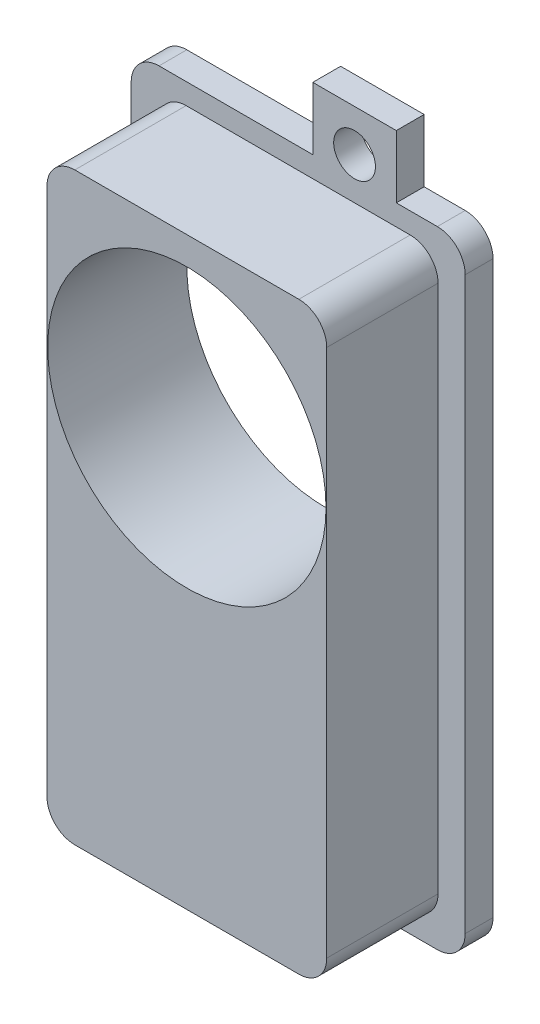
ISO-10303-21;
HEADER;
FILE_DESCRIPTION(('STEP AP214'),'2;1');
FILE_NAME('part.step','',(''),(''),'','','');
FILE_SCHEMA(('AUTOMOTIVE_DESIGN { 1 0 10303 214 1 1 1 1 }'));
ENDSEC;
DATA;
#1=APPLICATION_CONTEXT('core data for automotive mechanical design processes');
#2=APPLICATION_PROTOCOL_DEFINITION('international standard','automotive_design',2000,#1);
#3=PRODUCT_CONTEXT('',#1,'mechanical');
#4=PRODUCT('Part','Part','',(#3));
#5=PRODUCT_RELATED_PRODUCT_CATEGORY('part','',(#4));
#6=PRODUCT_DEFINITION_FORMATION('','',#4);
#7=PRODUCT_DEFINITION_CONTEXT('part definition',#1,'design');
#8=PRODUCT_DEFINITION('design','',#6,#7);
#9=PRODUCT_DEFINITION_SHAPE('','',#8);
#10=(LENGTH_UNIT() NAMED_UNIT(*) SI_UNIT(.MILLI.,.METRE.));
#11=(NAMED_UNIT(*) PLANE_ANGLE_UNIT() SI_UNIT($,.RADIAN.));
#12=(NAMED_UNIT(*) SI_UNIT($,.STERADIAN.) SOLID_ANGLE_UNIT());
#13=UNCERTAINTY_MEASURE_WITH_UNIT(LENGTH_MEASURE(1.E-05),#10,'distance_accuracy_value','');
#14=(GEOMETRIC_REPRESENTATION_CONTEXT(3) GLOBAL_UNCERTAINTY_ASSIGNED_CONTEXT((#13)) GLOBAL_UNIT_ASSIGNED_CONTEXT((#10,
#11,#12)) REPRESENTATION_CONTEXT('',''));
#15=CARTESIAN_POINT('',(0.,0.,0.));
#16=DIRECTION('',(0.,0.,1.));
#17=DIRECTION('',(1.,0.,0.));
#18=AXIS2_PLACEMENT_3D('',#15,#16,#17);
#19=CARTESIAN_POINT('',(0.,0.,2.));
#20=DIRECTION('',(0.,0.,-1.));
#21=DIRECTION('',(-1.,0.,0.));
#22=AXIS2_PLACEMENT_3D('',#19,#20,#21);
#23=PLANE('',#22);
#24=CARTESIAN_POINT('',(-4.05,-24.,2.));
#25=DIRECTION('',(0.,0.,1.));
#26=DIRECTION('',(1.,0.,0.));
#27=AXIS2_PLACEMENT_3D('',#24,#25,#26);
#28=CIRCLE('',#27,1.5);
#29=CARTESIAN_POINT('',(-2.55,-24.,2.));
#30=VERTEX_POINT('',#29);
#31=EDGE_CURVE('E467',#30,#30,#28,.T.);
#32=ORIENTED_EDGE('',*,*,#31,.F.);
#33=EDGE_LOOP('',(#32));
#34=FACE_BOUND('',#33,.T.);
#35=CARTESIAN_POINT('',(4.05,24.,2.));
#36=DIRECTION('',(0.,0.,1.));
#37=DIRECTION('',(1.,0.,0.));
#38=AXIS2_PLACEMENT_3D('',#35,#36,#37);
#39=CIRCLE('',#38,1.5);
#40=CARTESIAN_POINT('',(5.55,24.,2.));
#41=VERTEX_POINT('',#40);
#42=EDGE_CURVE('E263',#41,#41,#39,.T.);
#43=ORIENTED_EDGE('',*,*,#42,.F.);
#44=EDGE_LOOP('',(#43));
#45=FACE_BOUND('',#44,.T.);
#46=DIRECTION('',(1.,0.,0.));
#47=VECTOR('',#46,1.);
#48=CARTESIAN_POINT('',(12.,-22.5,2.));
#49=LINE('',#48,#47);
#50=CARTESIAN_POINT('',(-1.05,-22.5,2.));
#51=VERTEX_POINT('',#50);
#52=CARTESIAN_POINT('',(10.,-22.5,2.));
#53=VERTEX_POINT('',#52);
#54=EDGE_CURVE('E238',#51,#53,#49,.T.);
#55=ORIENTED_EDGE('',*,*,#54,.T.);
#56=CARTESIAN_POINT('',(10.,-20.5,2.));
#57=DIRECTION('',(0.,0.,-1.));
#58=DIRECTION('',(-1.,0.,0.));
#59=AXIS2_PLACEMENT_3D('',#56,#57,#58);
#60=CIRCLE('',#59,2.);
#61=CARTESIAN_POINT('',(12.,-20.5,2.));
#62=VERTEX_POINT('',#61);
#63=EDGE_CURVE('E353',#53,#62,#60,.F.);
#64=ORIENTED_EDGE('',*,*,#63,.T.);
#65=DIRECTION('',(0.,1.,0.));
#66=VECTOR('',#65,1.);
#67=CARTESIAN_POINT('',(12.,-22.5,2.));
#68=LINE('',#67,#66);
#69=CARTESIAN_POINT('',(12.,20.5,2.));
#70=VERTEX_POINT('',#69);
#71=EDGE_CURVE('E241',#62,#70,#68,.T.);
#72=ORIENTED_EDGE('',*,*,#71,.T.);
#73=CARTESIAN_POINT('',(10.,20.5,2.));
#74=DIRECTION('',(0.,0.,-1.));
#75=DIRECTION('',(-1.,0.,0.));
#76=AXIS2_PLACEMENT_3D('',#73,#74,#75);
#77=CIRCLE('',#76,2.);
#78=CARTESIAN_POINT('',(10.,22.5,2.));
#79=VERTEX_POINT('',#78);
#80=EDGE_CURVE('E345',#70,#79,#77,.F.);
#81=ORIENTED_EDGE('',*,*,#80,.T.);
#82=DIRECTION('',(-1.,0.,0.));
#83=VECTOR('',#82,1.);
#84=CARTESIAN_POINT('',(12.,22.5,2.));
#85=LINE('',#84,#83);
#86=CARTESIAN_POINT('',(7.05,22.5,2.));
#87=VERTEX_POINT('',#86);
#88=EDGE_CURVE('E245',#79,#87,#85,.T.);
#89=ORIENTED_EDGE('',*,*,#88,.T.);
#90=DIRECTION('',(0.,1.,0.));
#91=VECTOR('',#90,1.);
#92=CARTESIAN_POINT('',(7.05,27.,2.));
#93=LINE('',#92,#91);
#94=CARTESIAN_POINT('',(7.05,27.,2.));
#95=VERTEX_POINT('',#94);
#96=EDGE_CURVE('E248',#87,#95,#93,.T.);
#97=ORIENTED_EDGE('',*,*,#96,.T.);
#98=DIRECTION('',(-1.,0.,0.));
#99=VECTOR('',#98,1.);
#100=CARTESIAN_POINT('',(1.05,27.,2.));
#101=LINE('',#100,#99);
#102=CARTESIAN_POINT('',(1.05,27.,2.));
#103=VERTEX_POINT('',#102);
#104=EDGE_CURVE('E251',#95,#103,#101,.T.);
#105=ORIENTED_EDGE('',*,*,#104,.T.);
#106=DIRECTION('',(0.,-1.,0.));
#107=VECTOR('',#106,1.);
#108=CARTESIAN_POINT('',(1.05,22.5,2.));
#109=LINE('',#108,#107);
#110=CARTESIAN_POINT('',(1.05,22.5,2.));
#111=VERTEX_POINT('',#110);
#112=EDGE_CURVE('E254',#103,#111,#109,.T.);
#113=ORIENTED_EDGE('',*,*,#112,.T.);
#114=DIRECTION('',(-1.,0.,0.));
#115=VECTOR('',#114,1.);
#116=CARTESIAN_POINT('',(1.05,22.5,2.));
#117=LINE('',#116,#115);
#118=CARTESIAN_POINT('',(-10.,22.5,2.));
#119=VERTEX_POINT('',#118);
#120=EDGE_CURVE('E298',#111,#119,#117,.T.);
#121=ORIENTED_EDGE('',*,*,#120,.T.);
#122=CARTESIAN_POINT('',(-10.,20.5,2.));
#123=DIRECTION('',(0.,0.,-1.));
#124=DIRECTION('',(-1.,0.,0.));
#125=AXIS2_PLACEMENT_3D('',#122,#123,#124);
#126=CIRCLE('',#125,2.);
#127=CARTESIAN_POINT('',(-12.,20.5,2.));
#128=VERTEX_POINT('',#127);
#129=EDGE_CURVE('E348',#119,#128,#126,.F.);
#130=ORIENTED_EDGE('',*,*,#129,.T.);
#131=DIRECTION('',(0.,-1.,0.));
#132=VECTOR('',#131,1.);
#133=CARTESIAN_POINT('',(-12.,-22.5,2.));
#134=LINE('',#133,#132);
#135=CARTESIAN_POINT('',(-12.,-20.5,2.));
#136=VERTEX_POINT('',#135);
#137=EDGE_CURVE('E212',#128,#136,#134,.T.);
#138=ORIENTED_EDGE('',*,*,#137,.T.);
#139=CARTESIAN_POINT('',(-10.,-20.5,2.));
#140=DIRECTION('',(0.,0.,-1.));
#141=DIRECTION('',(-1.,0.,0.));
#142=AXIS2_PLACEMENT_3D('',#139,#140,#141);
#143=CIRCLE('',#142,2.);
#144=CARTESIAN_POINT('',(-10.,-22.5,2.));
#145=VERTEX_POINT('',#144);
#146=EDGE_CURVE('E207',#136,#145,#143,.F.);
#147=ORIENTED_EDGE('',*,*,#146,.T.);
#148=DIRECTION('',(1.,0.,0.));
#149=VECTOR('',#148,1.);
#150=CARTESIAN_POINT('',(-7.05,-22.5,2.));
#151=LINE('',#150,#149);
#152=CARTESIAN_POINT('',(-7.05,-22.5,2.));
#153=VERTEX_POINT('',#152);
#154=EDGE_CURVE('E199',#145,#153,#151,.T.);
#155=ORIENTED_EDGE('',*,*,#154,.T.);
#156=DIRECTION('',(0.,-1.,0.));
#157=VECTOR('',#156,1.);
#158=CARTESIAN_POINT('',(-7.05,-22.5,2.));
#159=LINE('',#158,#157);
#160=CARTESIAN_POINT('',(-7.05,-27.,2.));
#161=VERTEX_POINT('',#160);
#162=EDGE_CURVE('E203',#153,#161,#159,.T.);
#163=ORIENTED_EDGE('',*,*,#162,.T.);
#164=DIRECTION('',(1.,0.,0.));
#165=VECTOR('',#164,1.);
#166=CARTESIAN_POINT('',(-7.05,-27.,2.));
#167=LINE('',#166,#165);
#168=CARTESIAN_POINT('',(-1.05,-27.,2.));
#169=VERTEX_POINT('',#168);
#170=EDGE_CURVE('E229',#161,#169,#167,.T.);
#171=ORIENTED_EDGE('',*,*,#170,.T.);
#172=DIRECTION('',(0.,1.,0.));
#173=VECTOR('',#172,1.);
#174=CARTESIAN_POINT('',(-1.05,-27.,2.));
#175=LINE('',#174,#173);
#176=EDGE_CURVE('E232',#169,#51,#175,.T.);
#177=ORIENTED_EDGE('',*,*,#176,.T.);
#178=EDGE_LOOP('',(#55,#64,#72,#81,#89,#97,#105,#113,#121,#130,#138,#147,#155,#163,#171,#177));
#179=FACE_BOUND('',#178,.T.);
#180=DIRECTION('',(0.,-1.,0.));
#181=VECTOR('',#180,1.);
#182=CARTESIAN_POINT('',(-10.05,-21.,2.));
#183=LINE('',#182,#181);
#184=CARTESIAN_POINT('',(-10.05,19.,2.));
#185=VERTEX_POINT('',#184);
#186=CARTESIAN_POINT('',(-10.05,-19.,2.));
#187=VERTEX_POINT('',#186);
#188=EDGE_CURVE('E432',#185,#187,#183,.T.);
#189=ORIENTED_EDGE('',*,*,#188,.F.);
#190=CARTESIAN_POINT('',(-8.05,19.,2.));
#191=DIRECTION('',(0.,0.,-1.));
#192=DIRECTION('',(-1.,0.,0.));
#193=AXIS2_PLACEMENT_3D('',#190,#191,#192);
#194=CIRCLE('',#193,2.);
#195=CARTESIAN_POINT('',(-8.05,21.,2.));
#196=VERTEX_POINT('',#195);
#197=EDGE_CURVE('E11',#185,#196,#194,.T.);
#198=ORIENTED_EDGE('',*,*,#197,.T.);
#199=DIRECTION('',(-1.,0.,0.));
#200=VECTOR('',#199,1.);
#201=CARTESIAN_POINT('',(10.05,21.,2.));
#202=LINE('',#201,#200);
#203=CARTESIAN_POINT('',(8.05,21.,2.));
#204=VERTEX_POINT('',#203);
#205=EDGE_CURVE('E463',#204,#196,#202,.T.);
#206=ORIENTED_EDGE('',*,*,#205,.F.);
#207=CARTESIAN_POINT('',(8.05,19.,2.));
#208=DIRECTION('',(0.,0.,-1.));
#209=DIRECTION('',(-1.,0.,0.));
#210=AXIS2_PLACEMENT_3D('',#207,#208,#209);
#211=CIRCLE('',#210,2.);
#212=CARTESIAN_POINT('',(10.05,19.,2.));
#213=VERTEX_POINT('',#212);
#214=EDGE_CURVE('E412',#204,#213,#211,.T.);
#215=ORIENTED_EDGE('',*,*,#214,.T.);
#216=DIRECTION('',(0.,1.,0.));
#217=VECTOR('',#216,1.);
#218=CARTESIAN_POINT('',(10.05,-21.,2.));
#219=LINE('',#218,#217);
#220=CARTESIAN_POINT('',(10.05,-19.,2.));
#221=VERTEX_POINT('',#220);
#222=EDGE_CURVE('E422',#221,#213,#219,.T.);
#223=ORIENTED_EDGE('',*,*,#222,.F.);
#224=CARTESIAN_POINT('',(8.05,-19.,2.));
#225=DIRECTION('',(0.,0.,-1.));
#226=DIRECTION('',(-1.,0.,0.));
#227=AXIS2_PLACEMENT_3D('',#224,#225,#226);
#228=CIRCLE('',#227,2.);
#229=CARTESIAN_POINT('',(8.05,-21.,2.));
#230=VERTEX_POINT('',#229);
#231=EDGE_CURVE('E415',#221,#230,#228,.T.);
#232=ORIENTED_EDGE('',*,*,#231,.T.);
#233=DIRECTION('',(1.,0.,0.));
#234=VECTOR('',#233,1.);
#235=CARTESIAN_POINT('',(10.05,-21.,2.));
#236=LINE('',#235,#234);
#237=CARTESIAN_POINT('',(-8.05,-21.,2.));
#238=VERTEX_POINT('',#237);
#239=EDGE_CURVE('E420',#238,#230,#236,.T.);
#240=ORIENTED_EDGE('',*,*,#239,.F.);
#241=CARTESIAN_POINT('',(-8.05,-19.,2.));
#242=DIRECTION('',(0.,0.,-1.));
#243=DIRECTION('',(-1.,0.,0.));
#244=AXIS2_PLACEMENT_3D('',#241,#242,#243);
#245=CIRCLE('',#244,2.);
#246=EDGE_CURVE('E48',#238,#187,#245,.T.);
#247=ORIENTED_EDGE('',*,*,#246,.T.);
#248=EDGE_LOOP('',(#189,#198,#206,#215,#223,#232,#240,#247));
#249=FACE_BOUND('',#248,.T.);
#250=ADVANCED_FACE('F39',(#34,#45,#179,#249),#23,.F.);
#251=CARTESIAN_POINT('',(0.,0.,0.));
#252=DIRECTION('',(0.,0.,-1.));
#253=DIRECTION('',(-1.,0.,0.));
#254=AXIS2_PLACEMENT_3D('',#251,#252,#253);
#255=PLANE('',#254);
#256=CARTESIAN_POINT('',(0.,9.,0.));
#257=DIRECTION('',(0.,0.,1.));
#258=DIRECTION('',(1.,0.,0.));
#259=AXIS2_PLACEMENT_3D('',#256,#257,#258);
#260=CIRCLE('',#259,9.99999999999999);
#261=CARTESIAN_POINT('',(10.,9.,0.));
#262=VERTEX_POINT('',#261);
#263=EDGE_CURVE('E459',#262,#262,#260,.T.);
#264=ORIENTED_EDGE('',*,*,#263,.T.);
#265=EDGE_LOOP('',(#264));
#266=FACE_BOUND('',#265,.T.);
#267=CARTESIAN_POINT('',(4.05,24.,0.));
#268=DIRECTION('',(0.,0.,1.));
#269=DIRECTION('',(1.,0.,0.));
#270=AXIS2_PLACEMENT_3D('',#267,#268,#269);
#271=CIRCLE('',#270,1.5);
#272=CARTESIAN_POINT('',(5.55,24.,0.));
#273=VERTEX_POINT('',#272);
#274=EDGE_CURVE('E471',#273,#273,#271,.T.);
#275=ORIENTED_EDGE('',*,*,#274,.T.);
#276=EDGE_LOOP('',(#275));
#277=FACE_BOUND('',#276,.T.);
#278=DIRECTION('',(0.,1.,0.));
#279=VECTOR('',#278,1.);
#280=CARTESIAN_POINT('',(12.,-22.5,0.));
#281=LINE('',#280,#279);
#282=CARTESIAN_POINT('',(12.,-20.5,0.));
#283=VERTEX_POINT('',#282);
#284=CARTESIAN_POINT('',(12.,20.5,0.));
#285=VERTEX_POINT('',#284);
#286=EDGE_CURVE('E282',#283,#285,#281,.T.);
#287=ORIENTED_EDGE('',*,*,#286,.F.);
#288=CARTESIAN_POINT('',(10.,-20.5,0.));
#289=DIRECTION('',(0.,0.,-1.));
#290=DIRECTION('',(-1.,0.,0.));
#291=AXIS2_PLACEMENT_3D('',#288,#289,#290);
#292=CIRCLE('',#291,2.);
#293=CARTESIAN_POINT('',(10.,-22.5,0.));
#294=VERTEX_POINT('',#293);
#295=EDGE_CURVE('E339',#283,#294,#292,.T.);
#296=ORIENTED_EDGE('',*,*,#295,.T.);
#297=DIRECTION('',(1.,0.,0.));
#298=VECTOR('',#297,1.);
#299=CARTESIAN_POINT('',(12.,-22.5,0.));
#300=LINE('',#299,#298);
#301=CARTESIAN_POINT('',(-1.05,-22.5,0.));
#302=VERTEX_POINT('',#301);
#303=EDGE_CURVE('E278',#302,#294,#300,.T.);
#304=ORIENTED_EDGE('',*,*,#303,.F.);
#305=DIRECTION('',(0.,1.,0.));
#306=VECTOR('',#305,1.);
#307=CARTESIAN_POINT('',(-1.05,-27.,0.));
#308=LINE('',#307,#306);
#309=CARTESIAN_POINT('',(-1.05,-27.,0.));
#310=VERTEX_POINT('',#309);
#311=EDGE_CURVE('E275',#310,#302,#308,.T.);
#312=ORIENTED_EDGE('',*,*,#311,.F.);
#313=DIRECTION('',(1.,0.,0.));
#314=VECTOR('',#313,1.);
#315=CARTESIAN_POINT('',(-7.05,-27.,0.));
#316=LINE('',#315,#314);
#317=CARTESIAN_POINT('',(-7.05,-27.,0.));
#318=VERTEX_POINT('',#317);
#319=EDGE_CURVE('E272',#318,#310,#316,.T.);
#320=ORIENTED_EDGE('',*,*,#319,.F.);
#321=DIRECTION('',(0.,-1.,0.));
#322=VECTOR('',#321,1.);
#323=CARTESIAN_POINT('',(-7.05,-22.5,0.));
#324=LINE('',#323,#322);
#325=CARTESIAN_POINT('',(-7.05,-22.5,0.));
#326=VERTEX_POINT('',#325);
#327=EDGE_CURVE('E269',#326,#318,#324,.T.);
#328=ORIENTED_EDGE('',*,*,#327,.F.);
#329=DIRECTION('',(1.,0.,0.));
#330=VECTOR('',#329,1.);
#331=CARTESIAN_POINT('',(-7.05,-22.5,0.));
#332=LINE('',#331,#330);
#333=CARTESIAN_POINT('',(-10.,-22.5,0.));
#334=VERTEX_POINT('',#333);
#335=EDGE_CURVE('E218',#334,#326,#332,.T.);
#336=ORIENTED_EDGE('',*,*,#335,.F.);
#337=CARTESIAN_POINT('',(-10.,-20.5,0.));
#338=DIRECTION('',(0.,0.,-1.));
#339=DIRECTION('',(-1.,0.,0.));
#340=AXIS2_PLACEMENT_3D('',#337,#338,#339);
#341=CIRCLE('',#340,2.);
#342=CARTESIAN_POINT('',(-12.,-20.5,0.));
#343=VERTEX_POINT('',#342);
#344=EDGE_CURVE('E336',#334,#343,#341,.T.);
#345=ORIENTED_EDGE('',*,*,#344,.T.);
#346=DIRECTION('',(0.,-1.,0.));
#347=VECTOR('',#346,1.);
#348=CARTESIAN_POINT('',(-12.,-22.5,0.));
#349=LINE('',#348,#347);
#350=CARTESIAN_POINT('',(-12.,20.5,0.));
#351=VERTEX_POINT('',#350);
#352=EDGE_CURVE('E262',#351,#343,#349,.T.);
#353=ORIENTED_EDGE('',*,*,#352,.F.);
#354=CARTESIAN_POINT('',(-10.,20.5,0.));
#355=DIRECTION('',(0.,0.,-1.));
#356=DIRECTION('',(-1.,0.,0.));
#357=AXIS2_PLACEMENT_3D('',#354,#355,#356);
#358=CIRCLE('',#357,2.);
#359=CARTESIAN_POINT('',(-10.,22.5,0.));
#360=VERTEX_POINT('',#359);
#361=EDGE_CURVE('E333',#351,#360,#358,.T.);
#362=ORIENTED_EDGE('',*,*,#361,.T.);
#363=DIRECTION('',(-1.,0.,0.));
#364=VECTOR('',#363,1.);
#365=CARTESIAN_POINT('',(1.05,22.5,0.));
#366=LINE('',#365,#364);
#367=CARTESIAN_POINT('',(1.05,22.5,0.));
#368=VERTEX_POINT('',#367);
#369=EDGE_CURVE('E258',#368,#360,#366,.T.);
#370=ORIENTED_EDGE('',*,*,#369,.F.);
#371=DIRECTION('',(0.,-1.,0.));
#372=VECTOR('',#371,1.);
#373=CARTESIAN_POINT('',(1.05,22.5,0.));
#374=LINE('',#373,#372);
#375=CARTESIAN_POINT('',(1.05,27.,0.));
#376=VERTEX_POINT('',#375);
#377=EDGE_CURVE('E295',#376,#368,#374,.T.);
#378=ORIENTED_EDGE('',*,*,#377,.F.);
#379=DIRECTION('',(-1.,0.,0.));
#380=VECTOR('',#379,1.);
#381=CARTESIAN_POINT('',(1.05,27.,0.));
#382=LINE('',#381,#380);
#383=CARTESIAN_POINT('',(7.05,27.,0.));
#384=VERTEX_POINT('',#383);
#385=EDGE_CURVE('E292',#384,#376,#382,.T.);
#386=ORIENTED_EDGE('',*,*,#385,.F.);
#387=DIRECTION('',(0.,1.,0.));
#388=VECTOR('',#387,1.);
#389=CARTESIAN_POINT('',(7.05,27.,0.));
#390=LINE('',#389,#388);
#391=CARTESIAN_POINT('',(7.05,22.5,0.));
#392=VERTEX_POINT('',#391);
#393=EDGE_CURVE('E289',#392,#384,#390,.T.);
#394=ORIENTED_EDGE('',*,*,#393,.F.);
#395=DIRECTION('',(-1.,0.,0.));
#396=VECTOR('',#395,1.);
#397=CARTESIAN_POINT('',(12.,22.5,0.));
#398=LINE('',#397,#396);
#399=CARTESIAN_POINT('',(10.,22.5,0.));
#400=VERTEX_POINT('',#399);
#401=EDGE_CURVE('E286',#400,#392,#398,.T.);
#402=ORIENTED_EDGE('',*,*,#401,.F.);
#403=CARTESIAN_POINT('',(10.,20.5,0.));
#404=DIRECTION('',(0.,0.,-1.));
#405=DIRECTION('',(-1.,0.,0.));
#406=AXIS2_PLACEMENT_3D('',#403,#404,#405);
#407=CIRCLE('',#406,2.);
#408=EDGE_CURVE('E330',#400,#285,#407,.T.);
#409=ORIENTED_EDGE('',*,*,#408,.T.);
#410=EDGE_LOOP('',(#287,#296,#304,#312,#320,#328,#336,#345,#353,#362,#370,#378,#386,#394,#402,#409));
#411=FACE_BOUND('',#410,.T.);
#412=CARTESIAN_POINT('',(-4.05,-24.,0.));
#413=DIRECTION('',(0.,0.,1.));
#414=DIRECTION('',(1.,0.,0.));
#415=AXIS2_PLACEMENT_3D('',#412,#413,#414);
#416=CIRCLE('',#415,1.5);
#417=CARTESIAN_POINT('',(-2.55,-24.,0.));
#418=VERTEX_POINT('',#417);
#419=EDGE_CURVE('E452',#418,#418,#416,.T.);
#420=ORIENTED_EDGE('',*,*,#419,.T.);
#421=EDGE_LOOP('',(#420));
#422=FACE_BOUND('',#421,.T.);
#423=ADVANCED_FACE('F493',(#266,#277,#411,#422),#255,.T.);
#424=CARTESIAN_POINT('',(1.05,22.5,2.));
#425=DIRECTION('',(0.,-1.,0.));
#426=DIRECTION('',(1.,0.,0.));
#427=AXIS2_PLACEMENT_3D('',#424,#425,#426);
#428=PLANE('',#427);
#429=ORIENTED_EDGE('',*,*,#369,.T.);
#430=DIRECTION('',(0.,0.,-1.));
#431=VECTOR('',#430,1.);
#432=CARTESIAN_POINT('',(-10.,22.5,2.));
#433=LINE('',#432,#431);
#434=EDGE_CURVE('E366',#360,#119,#433,.F.);
#435=ORIENTED_EDGE('',*,*,#434,.T.);
#436=ORIENTED_EDGE('',*,*,#120,.F.);
#437=DIRECTION('',(0.,0.,-1.));
#438=VECTOR('',#437,1.);
#439=CARTESIAN_POINT('',(1.05,22.5,2.));
#440=LINE('',#439,#438);
#441=EDGE_CURVE('E257',#111,#368,#440,.T.);
#442=ORIENTED_EDGE('',*,*,#441,.T.);
#443=EDGE_LOOP('',(#429,#435,#436,#442));
#444=FACE_BOUND('',#443,.T.);
#445=ADVANCED_FACE('F545',(#444),#428,.F.);
#446=CARTESIAN_POINT('',(-12.,-22.5,2.));
#447=DIRECTION('',(1.,0.,0.));
#448=DIRECTION('',(0.,0.,-1.));
#449=AXIS2_PLACEMENT_3D('',#446,#447,#448);
#450=PLANE('',#449);
#451=ORIENTED_EDGE('',*,*,#352,.T.);
#452=DIRECTION('',(0.,0.,-1.));
#453=VECTOR('',#452,1.);
#454=CARTESIAN_POINT('',(-12.,-20.5,2.));
#455=LINE('',#454,#453);
#456=EDGE_CURVE('E363',#343,#136,#455,.F.);
#457=ORIENTED_EDGE('',*,*,#456,.T.);
#458=ORIENTED_EDGE('',*,*,#137,.F.);
#459=DIRECTION('',(0.,0.,-1.));
#460=VECTOR('',#459,1.);
#461=CARTESIAN_POINT('',(-12.,20.5,2.));
#462=LINE('',#461,#460);
#463=EDGE_CURVE('E359',#128,#351,#462,.T.);
#464=ORIENTED_EDGE('',*,*,#463,.T.);
#465=EDGE_LOOP('',(#451,#457,#458,#464));
#466=FACE_BOUND('',#465,.T.);
#467=ADVANCED_FACE('F549',(#466),#450,.F.);
#468=CARTESIAN_POINT('',(-7.05,-22.5,2.));
#469=DIRECTION('',(0.,1.,0.));
#470=DIRECTION('',(-1.,0.,0.));
#471=AXIS2_PLACEMENT_3D('',#468,#469,#470);
#472=PLANE('',#471);
#473=ORIENTED_EDGE('',*,*,#154,.F.);
#474=DIRECTION('',(0.,0.,-1.));
#475=VECTOR('',#474,1.);
#476=CARTESIAN_POINT('',(-10.,-22.5,2.));
#477=LINE('',#476,#475);
#478=EDGE_CURVE('E356',#145,#334,#477,.T.);
#479=ORIENTED_EDGE('',*,*,#478,.T.);
#480=ORIENTED_EDGE('',*,*,#335,.T.);
#481=DIRECTION('',(0.,0.,-1.));
#482=VECTOR('',#481,1.);
#483=CARTESIAN_POINT('',(-7.05,-22.5,2.));
#484=LINE('',#483,#482);
#485=EDGE_CURVE('E215',#153,#326,#484,.T.);
#486=ORIENTED_EDGE('',*,*,#485,.F.);
#487=EDGE_LOOP('',(#473,#479,#480,#486));
#488=FACE_BOUND('',#487,.T.);
#489=ADVANCED_FACE('F216',(#488),#472,.F.);
#490=CARTESIAN_POINT('',(-7.05,-22.5,2.));
#491=DIRECTION('',(1.,0.,0.));
#492=DIRECTION('',(0.,0.,-1.));
#493=AXIS2_PLACEMENT_3D('',#490,#491,#492);
#494=PLANE('',#493);
#495=ORIENTED_EDGE('',*,*,#327,.T.);
#496=DIRECTION('',(0.,0.,-1.));
#497=VECTOR('',#496,1.);
#498=CARTESIAN_POINT('',(-7.05,-27.,2.));
#499=LINE('',#498,#497);
#500=EDGE_CURVE('E223',#161,#318,#499,.T.);
#501=ORIENTED_EDGE('',*,*,#500,.F.);
#502=ORIENTED_EDGE('',*,*,#162,.F.);
#503=ORIENTED_EDGE('',*,*,#485,.T.);
#504=EDGE_LOOP('',(#495,#501,#502,#503));
#505=FACE_BOUND('',#504,.T.);
#506=ADVANCED_FACE('F225',(#505),#494,.F.);
#507=CARTESIAN_POINT('',(-7.05,-27.,2.));
#508=DIRECTION('',(0.,1.,0.));
#509=DIRECTION('',(-1.,0.,0.));
#510=AXIS2_PLACEMENT_3D('',#507,#508,#509);
#511=PLANE('',#510);
#512=ORIENTED_EDGE('',*,*,#319,.T.);
#513=DIRECTION('',(0.,0.,-1.));
#514=VECTOR('',#513,1.);
#515=CARTESIAN_POINT('',(-1.05,-27.,2.));
#516=LINE('',#515,#514);
#517=EDGE_CURVE('E318',#169,#310,#516,.T.);
#518=ORIENTED_EDGE('',*,*,#517,.F.);
#519=ORIENTED_EDGE('',*,*,#170,.F.);
#520=ORIENTED_EDGE('',*,*,#500,.T.);
#521=EDGE_LOOP('',(#512,#518,#519,#520));
#522=FACE_BOUND('',#521,.T.);
#523=ADVANCED_FACE('F499',(#522),#511,.F.);
#524=CARTESIAN_POINT('',(-1.05,-27.,2.));
#525=DIRECTION('',(-1.,0.,0.));
#526=DIRECTION('',(0.,-1.,0.));
#527=AXIS2_PLACEMENT_3D('',#524,#525,#526);
#528=PLANE('',#527);
#529=ORIENTED_EDGE('',*,*,#311,.T.);
#530=DIRECTION('',(0.,0.,-1.));
#531=VECTOR('',#530,1.);
#532=CARTESIAN_POINT('',(-1.05,-22.5,2.));
#533=LINE('',#532,#531);
#534=EDGE_CURVE('E314',#51,#302,#533,.T.);
#535=ORIENTED_EDGE('',*,*,#534,.F.);
#536=ORIENTED_EDGE('',*,*,#176,.F.);
#537=ORIENTED_EDGE('',*,*,#517,.T.);
#538=EDGE_LOOP('',(#529,#535,#536,#537));
#539=FACE_BOUND('',#538,.T.);
#540=ADVANCED_FACE('F506',(#539),#528,.F.);
#541=CARTESIAN_POINT('',(12.,-22.5,2.));
#542=DIRECTION('',(0.,1.,0.));
#543=DIRECTION('',(-1.,0.,0.));
#544=AXIS2_PLACEMENT_3D('',#541,#542,#543);
#545=PLANE('',#544);
#546=ORIENTED_EDGE('',*,*,#303,.T.);
#547=DIRECTION('',(0.,0.,-1.));
#548=VECTOR('',#547,1.);
#549=CARTESIAN_POINT('',(10.,-22.5,2.));
#550=LINE('',#549,#548);
#551=EDGE_CURVE('E342',#294,#53,#550,.F.);
#552=ORIENTED_EDGE('',*,*,#551,.T.);
#553=ORIENTED_EDGE('',*,*,#54,.F.);
#554=ORIENTED_EDGE('',*,*,#534,.T.);
#555=EDGE_LOOP('',(#546,#552,#553,#554));
#556=FACE_BOUND('',#555,.T.);
#557=ADVANCED_FACE('F509',(#556),#545,.F.);
#558=CARTESIAN_POINT('',(12.,-22.5,2.));
#559=DIRECTION('',(-1.,0.,0.));
#560=DIRECTION('',(0.,0.,1.));
#561=AXIS2_PLACEMENT_3D('',#558,#559,#560);
#562=PLANE('',#561);
#563=ORIENTED_EDGE('',*,*,#71,.F.);
#564=DIRECTION('',(0.,0.,-1.));
#565=VECTOR('',#564,1.);
#566=CARTESIAN_POINT('',(12.,-20.5,2.));
#567=LINE('',#566,#565);
#568=EDGE_CURVE('E326',#62,#283,#567,.T.);
#569=ORIENTED_EDGE('',*,*,#568,.T.);
#570=ORIENTED_EDGE('',*,*,#286,.T.);
#571=DIRECTION('',(0.,0.,-1.));
#572=VECTOR('',#571,1.);
#573=CARTESIAN_POINT('',(12.,20.5,2.));
#574=LINE('',#573,#572);
#575=EDGE_CURVE('E222',#285,#70,#574,.F.);
#576=ORIENTED_EDGE('',*,*,#575,.T.);
#577=EDGE_LOOP('',(#563,#569,#570,#576));
#578=FACE_BOUND('',#577,.T.);
#579=ADVANCED_FACE('F517',(#578),#562,.F.);
#580=CARTESIAN_POINT('',(12.,22.5,2.));
#581=DIRECTION('',(0.,-1.,0.));
#582=DIRECTION('',(0.,0.,-1.));
#583=AXIS2_PLACEMENT_3D('',#580,#581,#582);
#584=PLANE('',#583);
#585=ORIENTED_EDGE('',*,*,#88,.F.);
#586=DIRECTION('',(0.,0.,-1.));
#587=VECTOR('',#586,1.);
#588=CARTESIAN_POINT('',(10.,22.5,2.));
#589=LINE('',#588,#587);
#590=EDGE_CURVE('E369',#79,#400,#589,.T.);
#591=ORIENTED_EDGE('',*,*,#590,.T.);
#592=ORIENTED_EDGE('',*,*,#401,.T.);
#593=DIRECTION('',(0.,0.,-1.));
#594=VECTOR('',#593,1.);
#595=CARTESIAN_POINT('',(7.05,22.5,2.));
#596=LINE('',#595,#594);
#597=EDGE_CURVE('E310',#87,#392,#596,.T.);
#598=ORIENTED_EDGE('',*,*,#597,.F.);
#599=EDGE_LOOP('',(#585,#591,#592,#598));
#600=FACE_BOUND('',#599,.T.);
#601=ADVANCED_FACE('F525',(#600),#584,.F.);
#602=CARTESIAN_POINT('',(7.05,27.,2.));
#603=DIRECTION('',(-1.,0.,0.));
#604=DIRECTION('',(0.,-1.,0.));
#605=AXIS2_PLACEMENT_3D('',#602,#603,#604);
#606=PLANE('',#605);
#607=ORIENTED_EDGE('',*,*,#393,.T.);
#608=DIRECTION('',(0.,0.,-1.));
#609=VECTOR('',#608,1.);
#610=CARTESIAN_POINT('',(7.05,27.,2.));
#611=LINE('',#610,#609);
#612=EDGE_CURVE('E306',#95,#384,#611,.T.);
#613=ORIENTED_EDGE('',*,*,#612,.F.);
#614=ORIENTED_EDGE('',*,*,#96,.F.);
#615=ORIENTED_EDGE('',*,*,#597,.T.);
#616=EDGE_LOOP('',(#607,#613,#614,#615));
#617=FACE_BOUND('',#616,.T.);
#618=ADVANCED_FACE('F531',(#617),#606,.F.);
#619=CARTESIAN_POINT('',(1.05,27.,2.));
#620=DIRECTION('',(0.,-1.,0.));
#621=DIRECTION('',(0.,0.,-1.));
#622=AXIS2_PLACEMENT_3D('',#619,#620,#621);
#623=PLANE('',#622);
#624=ORIENTED_EDGE('',*,*,#385,.T.);
#625=DIRECTION('',(0.,0.,-1.));
#626=VECTOR('',#625,1.);
#627=CARTESIAN_POINT('',(1.05,27.,2.));
#628=LINE('',#627,#626);
#629=EDGE_CURVE('E302',#103,#376,#628,.T.);
#630=ORIENTED_EDGE('',*,*,#629,.F.);
#631=ORIENTED_EDGE('',*,*,#104,.F.);
#632=ORIENTED_EDGE('',*,*,#612,.T.);
#633=EDGE_LOOP('',(#624,#630,#631,#632));
#634=FACE_BOUND('',#633,.T.);
#635=ADVANCED_FACE('F537',(#634),#623,.F.);
#636=CARTESIAN_POINT('',(1.05,22.5,2.));
#637=DIRECTION('',(1.,0.,0.));
#638=DIRECTION('',(0.,0.,-1.));
#639=AXIS2_PLACEMENT_3D('',#636,#637,#638);
#640=PLANE('',#639);
#641=ORIENTED_EDGE('',*,*,#377,.T.);
#642=ORIENTED_EDGE('',*,*,#441,.F.);
#643=ORIENTED_EDGE('',*,*,#112,.F.);
#644=ORIENTED_EDGE('',*,*,#629,.T.);
#645=EDGE_LOOP('',(#641,#642,#643,#644));
#646=FACE_BOUND('',#645,.T.);
#647=ADVANCED_FACE('F541',(#646),#640,.F.);
#648=CARTESIAN_POINT('',(4.05,24.,2.));
#649=DIRECTION('',(0.,0.,-1.));
#650=DIRECTION('',(-1.,0.,0.));
#651=AXIS2_PLACEMENT_3D('',#648,#649,#650);
#652=CYLINDRICAL_SURFACE('',#651,1.5);
#653=ORIENTED_EDGE('',*,*,#42,.T.);
#654=EDGE_LOOP('',(#653));
#655=FACE_BOUND('',#654,.T.);
#656=ORIENTED_EDGE('',*,*,#274,.F.);
#657=EDGE_LOOP('',(#656));
#658=FACE_BOUND('',#657,.T.);
#659=ADVANCED_FACE('F569',(#655,#658),#652,.F.);
#660=CARTESIAN_POINT('',(-4.05,-24.,2.));
#661=DIRECTION('',(0.,0.,-1.));
#662=DIRECTION('',(-1.,0.,0.));
#663=AXIS2_PLACEMENT_3D('',#660,#661,#662);
#664=CYLINDRICAL_SURFACE('',#663,1.5);
#665=ORIENTED_EDGE('',*,*,#31,.T.);
#666=EDGE_LOOP('',(#665));
#667=FACE_BOUND('',#666,.T.);
#668=ORIENTED_EDGE('',*,*,#419,.F.);
#669=EDGE_LOOP('',(#668));
#670=FACE_BOUND('',#669,.T.);
#671=ADVANCED_FACE('F632',(#667,#670),#664,.F.);
#672=CARTESIAN_POINT('',(10.,-20.5,2.));
#673=DIRECTION('',(0.,0.,-1.));
#674=DIRECTION('',(-1.,0.,0.));
#675=AXIS2_PLACEMENT_3D('',#672,#673,#674);
#676=CYLINDRICAL_SURFACE('',#675,2.);
#677=ORIENTED_EDGE('',*,*,#63,.F.);
#678=ORIENTED_EDGE('',*,*,#551,.F.);
#679=ORIENTED_EDGE('',*,*,#295,.F.);
#680=ORIENTED_EDGE('',*,*,#568,.F.);
#681=EDGE_LOOP('',(#677,#678,#679,#680));
#682=FACE_BOUND('',#681,.T.);
#683=ADVANCED_FACE('F512',(#682),#676,.T.);
#684=CARTESIAN_POINT('',(-10.,-20.5,2.));
#685=DIRECTION('',(0.,0.,-1.));
#686=DIRECTION('',(-1.,0.,0.));
#687=AXIS2_PLACEMENT_3D('',#684,#685,#686);
#688=CYLINDRICAL_SURFACE('',#687,2.);
#689=ORIENTED_EDGE('',*,*,#146,.F.);
#690=ORIENTED_EDGE('',*,*,#456,.F.);
#691=ORIENTED_EDGE('',*,*,#344,.F.);
#692=ORIENTED_EDGE('',*,*,#478,.F.);
#693=EDGE_LOOP('',(#689,#690,#691,#692));
#694=FACE_BOUND('',#693,.T.);
#695=ADVANCED_FACE('F490',(#694),#688,.T.);
#696=CARTESIAN_POINT('',(-10.,20.5,2.));
#697=DIRECTION('',(0.,0.,-1.));
#698=DIRECTION('',(-1.,0.,0.));
#699=AXIS2_PLACEMENT_3D('',#696,#697,#698);
#700=CYLINDRICAL_SURFACE('',#699,2.);
#701=ORIENTED_EDGE('',*,*,#129,.F.);
#702=ORIENTED_EDGE('',*,*,#434,.F.);
#703=ORIENTED_EDGE('',*,*,#361,.F.);
#704=ORIENTED_EDGE('',*,*,#463,.F.);
#705=EDGE_LOOP('',(#701,#702,#703,#704));
#706=FACE_BOUND('',#705,.T.);
#707=ADVANCED_FACE('F548',(#706),#700,.T.);
#708=CARTESIAN_POINT('',(10.,20.5,2.));
#709=DIRECTION('',(0.,0.,-1.));
#710=DIRECTION('',(-1.,0.,0.));
#711=AXIS2_PLACEMENT_3D('',#708,#709,#710);
#712=CYLINDRICAL_SURFACE('',#711,2.);
#713=ORIENTED_EDGE('',*,*,#80,.F.);
#714=ORIENTED_EDGE('',*,*,#575,.F.);
#715=ORIENTED_EDGE('',*,*,#408,.F.);
#716=ORIENTED_EDGE('',*,*,#590,.F.);
#717=EDGE_LOOP('',(#713,#714,#715,#716));
#718=FACE_BOUND('',#717,.T.);
#719=ADVANCED_FACE('F520',(#718),#712,.T.);
#720=CARTESIAN_POINT('',(-10.05,-21.,10.));
#721=DIRECTION('',(1.,0.,0.));
#722=DIRECTION('',(0.,0.,-1.));
#723=AXIS2_PLACEMENT_3D('',#720,#721,#722);
#724=PLANE('',#723);
#725=ORIENTED_EDGE('',*,*,#188,.T.);
#726=DIRECTION('',(0.,0.,-1.));
#727=VECTOR('',#726,1.);
#728=CARTESIAN_POINT('',(-10.05,-19.,10.));
#729=LINE('',#728,#727);
#730=CARTESIAN_POINT('',(-10.05,-19.,10.));
#731=VERTEX_POINT('',#730);
#732=EDGE_CURVE('E409',#187,#731,#729,.F.);
#733=ORIENTED_EDGE('',*,*,#732,.T.);
#734=DIRECTION('',(0.,-1.,0.));
#735=VECTOR('',#734,1.);
#736=CARTESIAN_POINT('',(-10.05,-21.,10.));
#737=LINE('',#736,#735);
#738=CARTESIAN_POINT('',(-10.05,19.,10.));
#739=VERTEX_POINT('',#738);
#740=EDGE_CURVE('E454',#739,#731,#737,.T.);
#741=ORIENTED_EDGE('',*,*,#740,.F.);
#742=DIRECTION('',(0.,0.,-1.));
#743=VECTOR('',#742,1.);
#744=CARTESIAN_POINT('',(-10.05,19.,10.));
#745=LINE('',#744,#743);
#746=EDGE_CURVE('E406',#739,#185,#745,.T.);
#747=ORIENTED_EDGE('',*,*,#746,.T.);
#748=EDGE_LOOP('',(#725,#733,#741,#747));
#749=FACE_BOUND('',#748,.T.);
#750=ADVANCED_FACE('F663',(#749),#724,.F.);
#751=CARTESIAN_POINT('',(10.05,-21.,10.));
#752=DIRECTION('',(0.,1.,0.));
#753=DIRECTION('',(0.,0.,1.));
#754=AXIS2_PLACEMENT_3D('',#751,#752,#753);
#755=PLANE('',#754);
#756=ORIENTED_EDGE('',*,*,#239,.T.);
#757=DIRECTION('',(0.,0.,-1.));
#758=VECTOR('',#757,1.);
#759=CARTESIAN_POINT('',(8.05,-21.,10.));
#760=LINE('',#759,#758);
#761=CARTESIAN_POINT('',(8.05,-21.,10.));
#762=VERTEX_POINT('',#761);
#763=EDGE_CURVE('E403',#230,#762,#760,.F.);
#764=ORIENTED_EDGE('',*,*,#763,.T.);
#765=DIRECTION('',(1.,0.,0.));
#766=VECTOR('',#765,1.);
#767=CARTESIAN_POINT('',(10.05,-21.,10.));
#768=LINE('',#767,#766);
#769=CARTESIAN_POINT('',(-8.05,-21.,10.));
#770=VERTEX_POINT('',#769);
#771=EDGE_CURVE('E442',#770,#762,#768,.T.);
#772=ORIENTED_EDGE('',*,*,#771,.F.);
#773=DIRECTION('',(0.,0.,-1.));
#774=VECTOR('',#773,1.);
#775=CARTESIAN_POINT('',(-8.05,-21.,10.));
#776=LINE('',#775,#774);
#777=EDGE_CURVE('E399',#770,#238,#776,.T.);
#778=ORIENTED_EDGE('',*,*,#777,.T.);
#779=EDGE_LOOP('',(#756,#764,#772,#778));
#780=FACE_BOUND('',#779,.T.);
#781=ADVANCED_FACE('F427',(#780),#755,.F.);
#782=CARTESIAN_POINT('',(10.05,-21.,10.));
#783=DIRECTION('',(-1.,0.,0.));
#784=DIRECTION('',(0.,0.,1.));
#785=AXIS2_PLACEMENT_3D('',#782,#783,#784);
#786=PLANE('',#785);
#787=ORIENTED_EDGE('',*,*,#222,.T.);
#788=DIRECTION('',(0.,0.,-1.));
#789=VECTOR('',#788,1.);
#790=CARTESIAN_POINT('',(10.05,19.,10.));
#791=LINE('',#790,#789);
#792=CARTESIAN_POINT('',(10.05,19.,10.));
#793=VERTEX_POINT('',#792);
#794=EDGE_CURVE('E384',#213,#793,#791,.F.);
#795=ORIENTED_EDGE('',*,*,#794,.T.);
#796=DIRECTION('',(0.,1.,0.));
#797=VECTOR('',#796,1.);
#798=CARTESIAN_POINT('',(10.05,-21.,10.));
#799=LINE('',#798,#797);
#800=CARTESIAN_POINT('',(10.05,-19.,10.));
#801=VERTEX_POINT('',#800);
#802=EDGE_CURVE('E440',#801,#793,#799,.T.);
#803=ORIENTED_EDGE('',*,*,#802,.F.);
#804=DIRECTION('',(0.,0.,-1.));
#805=VECTOR('',#804,1.);
#806=CARTESIAN_POINT('',(10.05,-19.,10.));
#807=LINE('',#806,#805);
#808=EDGE_CURVE('E380',#801,#221,#807,.T.);
#809=ORIENTED_EDGE('',*,*,#808,.T.);
#810=EDGE_LOOP('',(#787,#795,#803,#809));
#811=FACE_BOUND('',#810,.T.);
#812=ADVANCED_FACE('F444',(#811),#786,.F.);
#813=CARTESIAN_POINT('',(10.05,21.,10.));
#814=DIRECTION('',(0.,-1.,0.));
#815=DIRECTION('',(0.,0.,-1.));
#816=AXIS2_PLACEMENT_3D('',#813,#814,#815);
#817=PLANE('',#816);
#818=DIRECTION('',(-1.,0.,0.));
#819=VECTOR('',#818,1.);
#820=CARTESIAN_POINT('',(10.05,21.,10.));
#821=LINE('',#820,#819);
#822=CARTESIAN_POINT('',(8.05,21.,10.));
#823=VERTEX_POINT('',#822);
#824=CARTESIAN_POINT('',(-8.05,21.,10.));
#825=VERTEX_POINT('',#824);
#826=EDGE_CURVE('E447',#823,#825,#821,.T.);
#827=ORIENTED_EDGE('',*,*,#826,.F.);
#828=DIRECTION('',(0.,0.,-1.));
#829=VECTOR('',#828,1.);
#830=CARTESIAN_POINT('',(8.05,21.,10.));
#831=LINE('',#830,#829);
#832=EDGE_CURVE('E376',#823,#204,#831,.T.);
#833=ORIENTED_EDGE('',*,*,#832,.T.);
#834=ORIENTED_EDGE('',*,*,#205,.T.);
#835=DIRECTION('',(0.,0.,-1.));
#836=VECTOR('',#835,1.);
#837=CARTESIAN_POINT('',(-8.05,21.,10.));
#838=LINE('',#837,#836);
#839=EDGE_CURVE('E373',#196,#825,#838,.F.);
#840=ORIENTED_EDGE('',*,*,#839,.T.);
#841=EDGE_LOOP('',(#827,#833,#834,#840));
#842=FACE_BOUND('',#841,.T.);
#843=ADVANCED_FACE('F683',(#842),#817,.F.);
#844=CARTESIAN_POINT('',(0.,0.,10.));
#845=DIRECTION('',(0.,0.,1.));
#846=DIRECTION('',(1.,0.,0.));
#847=AXIS2_PLACEMENT_3D('',#844,#845,#846);
#848=PLANE('',#847);
#849=CARTESIAN_POINT('',(0.,9.,10.));
#850=DIRECTION('',(0.,0.,1.));
#851=DIRECTION('',(1.,0.,0.));
#852=AXIS2_PLACEMENT_3D('',#849,#850,#851);
#853=CIRCLE('',#852,9.99999999999999);
#854=CARTESIAN_POINT('',(10.,9.,10.));
#855=VERTEX_POINT('',#854);
#856=EDGE_CURVE('E812',#855,#855,#853,.T.);
#857=ORIENTED_EDGE('',*,*,#856,.F.);
#858=EDGE_LOOP('',(#857));
#859=FACE_BOUND('',#858,.T.);
#860=ORIENTED_EDGE('',*,*,#802,.T.);
#861=CARTESIAN_POINT('',(8.05,19.,10.));
#862=DIRECTION('',(0.,0.,1.));
#863=DIRECTION('',(1.,0.,0.));
#864=AXIS2_PLACEMENT_3D('',#861,#862,#863);
#865=CIRCLE('',#864,2.);
#866=EDGE_CURVE('E396',#793,#823,#865,.T.);
#867=ORIENTED_EDGE('',*,*,#866,.T.);
#868=ORIENTED_EDGE('',*,*,#826,.T.);
#869=CARTESIAN_POINT('',(-8.05,19.,10.));
#870=DIRECTION('',(0.,0.,1.));
#871=DIRECTION('',(1.,0.,0.));
#872=AXIS2_PLACEMENT_3D('',#869,#870,#871);
#873=CIRCLE('',#872,2.);
#874=EDGE_CURVE('E387',#825,#739,#873,.T.);
#875=ORIENTED_EDGE('',*,*,#874,.T.);
#876=ORIENTED_EDGE('',*,*,#740,.T.);
#877=CARTESIAN_POINT('',(-8.05,-19.,10.));
#878=DIRECTION('',(0.,0.,1.));
#879=DIRECTION('',(1.,0.,0.));
#880=AXIS2_PLACEMENT_3D('',#877,#878,#879);
#881=CIRCLE('',#880,2.);
#882=EDGE_CURVE('E390',#731,#770,#881,.T.);
#883=ORIENTED_EDGE('',*,*,#882,.T.);
#884=ORIENTED_EDGE('',*,*,#771,.T.);
#885=CARTESIAN_POINT('',(8.05,-19.,10.));
#886=DIRECTION('',(0.,0.,1.));
#887=DIRECTION('',(1.,0.,0.));
#888=AXIS2_PLACEMENT_3D('',#885,#886,#887);
#889=CIRCLE('',#888,2.);
#890=EDGE_CURVE('E393',#762,#801,#889,.T.);
#891=ORIENTED_EDGE('',*,*,#890,.T.);
#892=EDGE_LOOP('',(#860,#867,#868,#875,#876,#883,#884,#891));
#893=FACE_BOUND('',#892,.T.);
#894=ADVANCED_FACE('F439',(#859,#893),#848,.T.);
#895=CARTESIAN_POINT('',(8.05,19.,10.));
#896=DIRECTION('',(0.,0.,-1.));
#897=DIRECTION('',(-1.,0.,0.));
#898=AXIS2_PLACEMENT_3D('',#895,#896,#897);
#899=CYLINDRICAL_SURFACE('',#898,2.);
#900=ORIENTED_EDGE('',*,*,#866,.F.);
#901=ORIENTED_EDGE('',*,*,#794,.F.);
#902=ORIENTED_EDGE('',*,*,#214,.F.);
#903=ORIENTED_EDGE('',*,*,#832,.F.);
#904=EDGE_LOOP('',(#900,#901,#902,#903));
#905=FACE_BOUND('',#904,.T.);
#906=ADVANCED_FACE('F698',(#905),#899,.T.);
#907=CARTESIAN_POINT('',(8.05,-19.,10.));
#908=DIRECTION('',(0.,0.,-1.));
#909=DIRECTION('',(-1.,0.,0.));
#910=AXIS2_PLACEMENT_3D('',#907,#908,#909);
#911=CYLINDRICAL_SURFACE('',#910,2.);
#912=ORIENTED_EDGE('',*,*,#890,.F.);
#913=ORIENTED_EDGE('',*,*,#763,.F.);
#914=ORIENTED_EDGE('',*,*,#231,.F.);
#915=ORIENTED_EDGE('',*,*,#808,.F.);
#916=EDGE_LOOP('',(#912,#913,#914,#915));
#917=FACE_BOUND('',#916,.T.);
#918=ADVANCED_FACE('F435',(#917),#911,.T.);
#919=CARTESIAN_POINT('',(-8.05,-19.,10.));
#920=DIRECTION('',(0.,0.,-1.));
#921=DIRECTION('',(-1.,0.,0.));
#922=AXIS2_PLACEMENT_3D('',#919,#920,#921);
#923=CYLINDRICAL_SURFACE('',#922,2.);
#924=ORIENTED_EDGE('',*,*,#882,.F.);
#925=ORIENTED_EDGE('',*,*,#732,.F.);
#926=ORIENTED_EDGE('',*,*,#246,.F.);
#927=ORIENTED_EDGE('',*,*,#777,.F.);
#928=EDGE_LOOP('',(#924,#925,#926,#927));
#929=FACE_BOUND('',#928,.T.);
#930=ADVANCED_FACE('F714',(#929),#923,.T.);
#931=CARTESIAN_POINT('',(-8.05,19.,10.));
#932=DIRECTION('',(0.,0.,-1.));
#933=DIRECTION('',(-1.,0.,0.));
#934=AXIS2_PLACEMENT_3D('',#931,#932,#933);
#935=CYLINDRICAL_SURFACE('',#934,2.);
#936=ORIENTED_EDGE('',*,*,#874,.F.);
#937=ORIENTED_EDGE('',*,*,#839,.F.);
#938=ORIENTED_EDGE('',*,*,#197,.F.);
#939=ORIENTED_EDGE('',*,*,#746,.F.);
#940=EDGE_LOOP('',(#936,#937,#938,#939));
#941=FACE_BOUND('',#940,.T.);
#942=ADVANCED_FACE('F41',(#941),#935,.T.);
#943=CARTESIAN_POINT('',(0.,9.,0.));
#944=DIRECTION('',(0.,0.,1.));
#945=DIRECTION('',(1.,0.,0.));
#946=AXIS2_PLACEMENT_3D('',#943,#944,#945);
#947=CYLINDRICAL_SURFACE('',#946,9.99999999999999);
#948=ORIENTED_EDGE('',*,*,#263,.F.);
#949=EDGE_LOOP('',(#948));
#950=FACE_BOUND('',#949,.T.);
#951=ORIENTED_EDGE('',*,*,#856,.T.);
#952=EDGE_LOOP('',(#951));
#953=FACE_BOUND('',#952,.T.);
#954=ADVANCED_FACE('F727',(#950,#953),#947,.F.);
#955=CLOSED_SHELL('',(#250,#423,#445,#467,#489,#506,#523,#540,#557,#579,#601,#618,#635,#647,
#659,#671,#683,#695,#707,#719,#750,#781,#812,#843,#894,#906,#918,#930,#942,#954));
#956=MANIFOLD_SOLID_BREP('B2',#955);
#957=ADVANCED_BREP_SHAPE_REPRESENTATION('',(#18,#956),#14);
#958=SHAPE_DEFINITION_REPRESENTATION(#9,#957);
ENDSEC;
END-ISO-10303-21;
